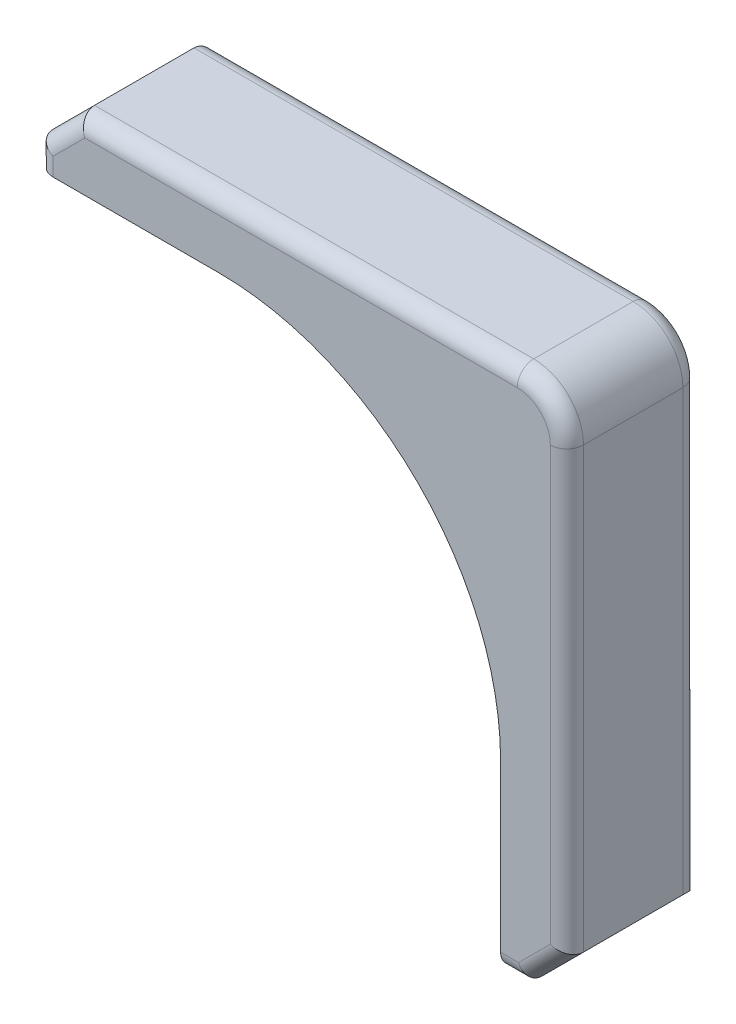
ISO-10303-21;
HEADER;
FILE_DESCRIPTION(('STEP AP214'),'2;1');
FILE_NAME('part.step','',(''),(''),'','','');
FILE_SCHEMA(('AUTOMOTIVE_DESIGN { 1 0 10303 214 1 1 1 1 }'));
ENDSEC;
DATA;
#1=APPLICATION_CONTEXT('core data for automotive mechanical design processes');
#2=APPLICATION_PROTOCOL_DEFINITION('international standard','automotive_design',2000,#1);
#3=PRODUCT_CONTEXT('',#1,'mechanical');
#4=PRODUCT('Part','Part','',(#3));
#5=PRODUCT_RELATED_PRODUCT_CATEGORY('part','',(#4));
#6=PRODUCT_DEFINITION_FORMATION('','',#4);
#7=PRODUCT_DEFINITION_CONTEXT('part definition',#1,'design');
#8=PRODUCT_DEFINITION('design','',#6,#7);
#9=PRODUCT_DEFINITION_SHAPE('','',#8);
#10=(LENGTH_UNIT() NAMED_UNIT(*) SI_UNIT(.MILLI.,.METRE.));
#11=(NAMED_UNIT(*) PLANE_ANGLE_UNIT() SI_UNIT($,.RADIAN.));
#12=(NAMED_UNIT(*) SI_UNIT($,.STERADIAN.) SOLID_ANGLE_UNIT());
#13=UNCERTAINTY_MEASURE_WITH_UNIT(LENGTH_MEASURE(1.E-05),#10,'distance_accuracy_value','');
#14=(GEOMETRIC_REPRESENTATION_CONTEXT(3) GLOBAL_UNCERTAINTY_ASSIGNED_CONTEXT((#13)) GLOBAL_UNIT_ASSIGNED_CONTEXT((#10,
#11,#12)) REPRESENTATION_CONTEXT('',''));
#15=CARTESIAN_POINT('',(0.,0.,0.));
#16=DIRECTION('',(0.,0.,1.));
#17=DIRECTION('',(1.,0.,0.));
#18=AXIS2_PLACEMENT_3D('',#15,#16,#17);
#19=CARTESIAN_POINT('',(-8.50000000000001,21.,8.));
#20=DIRECTION('',(0.707106781186548,-0.707106781186547,0.));
#21=DIRECTION('',(0.707106781186547,0.707106781186548,0.));
#22=AXIS2_PLACEMENT_3D('',#19,#20,#21);
#23=PLANE('',#22);
#24=DIRECTION('',(0.,0.,-1.));
#25=VECTOR('',#24,1.);
#26=CARTESIAN_POINT('',(-8.50000000000001,21.,8.));
#27=LINE('',#26,#25);
#28=CARTESIAN_POINT('',(-8.50000000000001,21.,7.));
#29=VERTEX_POINT('',#28);
#30=CARTESIAN_POINT('',(-8.50000000000001,21.,1.));
#31=VERTEX_POINT('',#30);
#32=EDGE_CURVE('E180',#29,#31,#27,.T.);
#33=ORIENTED_EDGE('',*,*,#32,.T.);
#34=DIRECTION('',(-0.707106781186547,-0.707106781186548,0.));
#35=VECTOR('',#34,1.);
#36=CARTESIAN_POINT('',(-8.50000000000001,21.,1.));
#37=LINE('',#36,#35);
#38=CARTESIAN_POINT('',(-11.,18.5,1.));
#39=VERTEX_POINT('',#38);
#40=EDGE_CURVE('E236',#31,#39,#37,.T.);
#41=ORIENTED_EDGE('',*,*,#40,.T.);
#42=DIRECTION('',(0.,0.,-1.));
#43=VECTOR('',#42,1.);
#44=CARTESIAN_POINT('',(-11.,18.5,8.));
#45=LINE('',#44,#43);
#46=CARTESIAN_POINT('',(-11.,18.5,7.));
#47=VERTEX_POINT('',#46);
#48=EDGE_CURVE('E212',#47,#39,#45,.T.);
#49=ORIENTED_EDGE('',*,*,#48,.F.);
#50=DIRECTION('',(-0.707106781186547,-0.707106781186548,0.));
#51=VECTOR('',#50,1.);
#52=CARTESIAN_POINT('',(-8.50000000000001,21.,7.));
#53=LINE('',#52,#51);
#54=EDGE_CURVE('E234',#47,#29,#53,.F.);
#55=ORIENTED_EDGE('',*,*,#54,.T.);
#56=EDGE_LOOP('',(#33,#41,#49,#55));
#57=FACE_BOUND('',#56,.T.);
#58=ADVANCED_FACE('F31',(#57),#23,.F.);
#59=CARTESIAN_POINT('',(-11.,18.5,8.));
#60=DIRECTION('',(1.,0.,0.));
#61=DIRECTION('',(0.,0.,-1.));
#62=AXIS2_PLACEMENT_3D('',#59,#60,#61);
#63=PLANE('',#62);
#64=ORIENTED_EDGE('',*,*,#48,.T.);
#65=DIRECTION('',(0.,-1.,0.));
#66=VECTOR('',#65,1.);
#67=CARTESIAN_POINT('',(-11.,18.5,1.));
#68=LINE('',#67,#66);
#69=CARTESIAN_POINT('',(-11.,17.,1.));
#70=VERTEX_POINT('',#69);
#71=EDGE_CURVE('E217',#39,#70,#68,.T.);
#72=ORIENTED_EDGE('',*,*,#71,.T.);
#73=DIRECTION('',(0.,0.,-1.));
#74=VECTOR('',#73,1.);
#75=CARTESIAN_POINT('',(-11.,17.,8.));
#76=LINE('',#75,#74);
#77=CARTESIAN_POINT('',(-11.,17.,7.));
#78=VERTEX_POINT('',#77);
#79=EDGE_CURVE('E172',#78,#70,#76,.T.);
#80=ORIENTED_EDGE('',*,*,#79,.F.);
#81=DIRECTION('',(0.,-1.,0.));
#82=VECTOR('',#81,1.);
#83=CARTESIAN_POINT('',(-11.,18.5,7.));
#84=LINE('',#83,#82);
#85=EDGE_CURVE('E215',#78,#47,#84,.F.);
#86=ORIENTED_EDGE('',*,*,#85,.T.);
#87=EDGE_LOOP('',(#64,#72,#80,#86));
#88=FACE_BOUND('',#87,.T.);
#89=ADVANCED_FACE('F305',(#88),#63,.F.);
#90=CARTESIAN_POINT('',(-11.,17.,8.));
#91=DIRECTION('',(0.,1.,0.));
#92=DIRECTION('',(0.,0.,1.));
#93=AXIS2_PLACEMENT_3D('',#90,#91,#92);
#94=PLANE('',#93);
#95=ORIENTED_EDGE('',*,*,#79,.T.);
#96=CARTESIAN_POINT('',(-10.,17.,1.));
#97=DIRECTION('',(0.,1.,0.));
#98=DIRECTION('',(0.,0.,1.));
#99=AXIS2_PLACEMENT_3D('',#96,#97,#98);
#100=CIRCLE('',#99,1.);
#101=CARTESIAN_POINT('',(-10.,17.,0.));
#102=VERTEX_POINT('',#101);
#103=EDGE_CURVE('E222',#70,#102,#100,.F.);
#104=ORIENTED_EDGE('',*,*,#103,.T.);
#105=DIRECTION('',(1.,0.,0.));
#106=VECTOR('',#105,1.);
#107=CARTESIAN_POINT('',(-11.,17.,0.));
#108=LINE('',#107,#106);
#109=CARTESIAN_POINT('',(0.,17.,0.));
#110=VERTEX_POINT('',#109);
#111=EDGE_CURVE('E169',#102,#110,#108,.T.);
#112=ORIENTED_EDGE('',*,*,#111,.T.);
#113=DIRECTION('',(0.,0.,-1.));
#114=VECTOR('',#113,1.);
#115=CARTESIAN_POINT('',(0.,17.,8.));
#116=LINE('',#115,#114);
#117=CARTESIAN_POINT('',(0.,17.,8.));
#118=VERTEX_POINT('',#117);
#119=EDGE_CURVE('E165',#118,#110,#116,.T.);
#120=ORIENTED_EDGE('',*,*,#119,.F.);
#121=DIRECTION('',(1.,0.,0.));
#122=VECTOR('',#121,1.);
#123=CARTESIAN_POINT('',(-11.,17.,8.));
#124=LINE('',#123,#122);
#125=CARTESIAN_POINT('',(-10.,17.,8.));
#126=VERTEX_POINT('',#125);
#127=EDGE_CURVE('E151',#126,#118,#124,.T.);
#128=ORIENTED_EDGE('',*,*,#127,.F.);
#129=CARTESIAN_POINT('',(-10.,17.,7.));
#130=DIRECTION('',(0.,1.,0.));
#131=DIRECTION('',(0.,0.,1.));
#132=AXIS2_PLACEMENT_3D('',#129,#130,#131);
#133=CIRCLE('',#132,1.);
#134=EDGE_CURVE('E220',#126,#78,#133,.F.);
#135=ORIENTED_EDGE('',*,*,#134,.T.);
#136=EDGE_LOOP('',(#95,#104,#112,#120,#128,#135));
#137=FACE_BOUND('',#136,.T.);
#138=ADVANCED_FACE('F167',(#137),#94,.F.);
#139=CARTESIAN_POINT('',(0.,0.,8.));
#140=DIRECTION('',(0.,0.,-1.));
#141=DIRECTION('',(-1.,0.,0.));
#142=AXIS2_PLACEMENT_3D('',#139,#140,#141);
#143=CYLINDRICAL_SURFACE('',#142,17.);
#144=CARTESIAN_POINT('',(0.,0.,0.));
#145=DIRECTION('',(0.,0.,-1.));
#146=DIRECTION('',(1.,0.,0.));
#147=AXIS2_PLACEMENT_3D('',#144,#145,#146);
#148=CIRCLE('',#147,17.);
#149=CARTESIAN_POINT('',(17.,0.,0.));
#150=VERTEX_POINT('',#149);
#151=EDGE_CURVE('E184',#110,#150,#148,.T.);
#152=ORIENTED_EDGE('',*,*,#151,.T.);
#153=DIRECTION('',(0.,0.,-1.));
#154=VECTOR('',#153,1.);
#155=CARTESIAN_POINT('',(17.,0.,8.));
#156=LINE('',#155,#154);
#157=CARTESIAN_POINT('',(17.,0.,8.));
#158=VERTEX_POINT('',#157);
#159=EDGE_CURVE('E173',#158,#150,#156,.T.);
#160=ORIENTED_EDGE('',*,*,#159,.F.);
#161=CARTESIAN_POINT('',(0.,0.,8.));
#162=DIRECTION('',(0.,0.,-1.));
#163=DIRECTION('',(1.,0.,0.));
#164=AXIS2_PLACEMENT_3D('',#161,#162,#163);
#165=CIRCLE('',#164,17.);
#166=EDGE_CURVE('E156',#118,#158,#165,.T.);
#167=ORIENTED_EDGE('',*,*,#166,.F.);
#168=ORIENTED_EDGE('',*,*,#119,.T.);
#169=EDGE_LOOP('',(#152,#160,#167,#168));
#170=FACE_BOUND('',#169,.T.);
#171=ADVANCED_FACE('F175',(#170),#143,.F.);
#172=CARTESIAN_POINT('',(17.,0.,8.));
#173=DIRECTION('',(1.,0.,0.));
#174=DIRECTION('',(0.,0.,-1.));
#175=AXIS2_PLACEMENT_3D('',#172,#173,#174);
#176=PLANE('',#175);
#177=DIRECTION('',(0.,0.,-1.));
#178=VECTOR('',#177,1.);
#179=CARTESIAN_POINT('',(17.,-11.,8.));
#180=LINE('',#179,#178);
#181=CARTESIAN_POINT('',(17.,-11.,7.));
#182=VERTEX_POINT('',#181);
#183=CARTESIAN_POINT('',(17.,-11.,0.));
#184=VERTEX_POINT('',#183);
#185=EDGE_CURVE('E208',#182,#184,#180,.T.);
#186=ORIENTED_EDGE('',*,*,#185,.F.);
#187=CARTESIAN_POINT('',(17.,-10.,7.));
#188=DIRECTION('',(1.,0.,0.));
#189=DIRECTION('',(0.,0.,-1.));
#190=AXIS2_PLACEMENT_3D('',#187,#188,#189);
#191=CIRCLE('',#190,1.);
#192=CARTESIAN_POINT('',(17.,-10.,8.));
#193=VERTEX_POINT('',#192);
#194=EDGE_CURVE('E11',#182,#193,#191,.F.);
#195=ORIENTED_EDGE('',*,*,#194,.T.);
#196=DIRECTION('',(0.,-1.,0.));
#197=VECTOR('',#196,1.);
#198=CARTESIAN_POINT('',(17.,0.,8.));
#199=LINE('',#198,#197);
#200=EDGE_CURVE('E178',#158,#193,#199,.T.);
#201=ORIENTED_EDGE('',*,*,#200,.F.);
#202=ORIENTED_EDGE('',*,*,#159,.T.);
#203=DIRECTION('',(0.,-1.,0.));
#204=VECTOR('',#203,1.);
#205=CARTESIAN_POINT('',(17.,0.,0.));
#206=LINE('',#205,#204);
#207=EDGE_CURVE('E187',#150,#184,#206,.T.);
#208=ORIENTED_EDGE('',*,*,#207,.T.);
#209=EDGE_LOOP('',(#186,#195,#201,#202,#208));
#210=FACE_BOUND('',#209,.T.);
#211=ADVANCED_FACE('F318',(#210),#176,.F.);
#212=CARTESIAN_POINT('',(17.,-11.,8.));
#213=DIRECTION('',(0.,1.,0.));
#214=DIRECTION('',(-1.,0.,0.));
#215=AXIS2_PLACEMENT_3D('',#212,#213,#214);
#216=PLANE('',#215);
#217=DIRECTION('',(0.,0.,-1.));
#218=VECTOR('',#217,1.);
#219=CARTESIAN_POINT('',(18.5,-11.,8.));
#220=LINE('',#219,#218);
#221=CARTESIAN_POINT('',(18.5,-11.,7.));
#222=VERTEX_POINT('',#221);
#223=CARTESIAN_POINT('',(18.5,-11.,0.));
#224=VERTEX_POINT('',#223);
#225=EDGE_CURVE('E206',#222,#224,#220,.T.);
#226=ORIENTED_EDGE('',*,*,#225,.F.);
#227=DIRECTION('',(1.,0.,0.));
#228=VECTOR('',#227,1.);
#229=CARTESIAN_POINT('',(17.,-11.,7.));
#230=LINE('',#229,#228);
#231=EDGE_CURVE('E40',#222,#182,#230,.F.);
#232=ORIENTED_EDGE('',*,*,#231,.T.);
#233=ORIENTED_EDGE('',*,*,#185,.T.);
#234=DIRECTION('',(1.,0.,0.));
#235=VECTOR('',#234,1.);
#236=CARTESIAN_POINT('',(17.,-11.,0.));
#237=LINE('',#236,#235);
#238=EDGE_CURVE('E190',#184,#224,#237,.T.);
#239=ORIENTED_EDGE('',*,*,#238,.T.);
#240=EDGE_LOOP('',(#226,#232,#233,#239));
#241=FACE_BOUND('',#240,.T.);
#242=ADVANCED_FACE('F376',(#241),#216,.F.);
#243=CARTESIAN_POINT('',(18.5,-11.,8.));
#244=DIRECTION('',(-0.707106781186549,0.707106781186546,0.));
#245=DIRECTION('',(-0.707106781186546,-0.707106781186549,0.));
#246=AXIS2_PLACEMENT_3D('',#243,#244,#245);
#247=PLANE('',#246);
#248=DIRECTION('',(0.707106781186546,0.707106781186549,0.));
#249=VECTOR('',#248,1.);
#250=CARTESIAN_POINT('',(18.5,-11.,0.));
#251=LINE('',#250,#249);
#252=CARTESIAN_POINT('',(20.,-9.50000000000001,0.));
#253=VERTEX_POINT('',#252);
#254=EDGE_CURVE('E162',#224,#253,#251,.T.);
#255=ORIENTED_EDGE('',*,*,#254,.T.);
#256=CARTESIAN_POINT('',(20.,-9.50000000000001,1.));
#257=DIRECTION('',(-0.707106781186549,0.707106781186546,0.));
#258=DIRECTION('',(0.707106781186546,0.707106781186549,0.));
#259=AXIS2_PLACEMENT_3D('',#256,#257,#258);
#260=ELLIPSE('',#259,1.4142135623731,1.);
#261=CARTESIAN_POINT('',(21.,-8.5,1.));
#262=VERTEX_POINT('',#261);
#263=EDGE_CURVE('E252',#253,#262,#260,.F.);
#264=ORIENTED_EDGE('',*,*,#263,.T.);
#265=DIRECTION('',(0.,0.,-1.));
#266=VECTOR('',#265,1.);
#267=CARTESIAN_POINT('',(21.,-8.5,8.));
#268=LINE('',#267,#266);
#269=CARTESIAN_POINT('',(21.,-8.5,7.));
#270=VERTEX_POINT('',#269);
#271=EDGE_CURVE('E203',#270,#262,#268,.T.);
#272=ORIENTED_EDGE('',*,*,#271,.F.);
#273=DIRECTION('',(0.707106781186546,0.707106781186549,0.));
#274=VECTOR('',#273,1.);
#275=CARTESIAN_POINT('',(18.5,-11.,7.));
#276=LINE('',#275,#274);
#277=EDGE_CURVE('E250',#270,#222,#276,.F.);
#278=ORIENTED_EDGE('',*,*,#277,.T.);
#279=ORIENTED_EDGE('',*,*,#225,.T.);
#280=EDGE_LOOP('',(#255,#264,#272,#278,#279));
#281=FACE_BOUND('',#280,.T.);
#282=ADVANCED_FACE('F366',(#281),#247,.F.);
#283=CARTESIAN_POINT('',(21.,-8.5,8.));
#284=DIRECTION('',(-1.,0.,0.));
#285=DIRECTION('',(0.,-1.,0.));
#286=AXIS2_PLACEMENT_3D('',#283,#284,#285);
#287=PLANE('',#286);
#288=ORIENTED_EDGE('',*,*,#271,.T.);
#289=DIRECTION('',(0.,1.,0.));
#290=VECTOR('',#289,1.);
#291=CARTESIAN_POINT('',(21.,-8.5,1.));
#292=LINE('',#291,#290);
#293=CARTESIAN_POINT('',(21.,18.,1.));
#294=VERTEX_POINT('',#293);
#295=EDGE_CURVE('E248',#262,#294,#292,.T.);
#296=ORIENTED_EDGE('',*,*,#295,.T.);
#297=DIRECTION('',(0.,0.,-1.));
#298=VECTOR('',#297,1.);
#299=CARTESIAN_POINT('',(21.,18.,8.));
#300=LINE('',#299,#298);
#301=CARTESIAN_POINT('',(21.,18.,7.));
#302=VERTEX_POINT('',#301);
#303=EDGE_CURVE('E200',#302,#294,#300,.T.);
#304=ORIENTED_EDGE('',*,*,#303,.F.);
#305=DIRECTION('',(0.,1.,0.));
#306=VECTOR('',#305,1.);
#307=CARTESIAN_POINT('',(21.,-8.5,7.));
#308=LINE('',#307,#306);
#309=EDGE_CURVE('E246',#302,#270,#308,.F.);
#310=ORIENTED_EDGE('',*,*,#309,.T.);
#311=EDGE_LOOP('',(#288,#296,#304,#310));
#312=FACE_BOUND('',#311,.T.);
#313=ADVANCED_FACE('F368',(#312),#287,.F.);
#314=CARTESIAN_POINT('',(18.,18.,8.));
#315=DIRECTION('',(0.,0.,-1.));
#316=DIRECTION('',(-1.,0.,0.));
#317=AXIS2_PLACEMENT_3D('',#314,#315,#316);
#318=CYLINDRICAL_SURFACE('',#317,3.);
#319=ORIENTED_EDGE('',*,*,#303,.T.);
#320=CARTESIAN_POINT('',(18.,18.,1.));
#321=DIRECTION('',(0.,0.,1.));
#322=DIRECTION('',(1.,0.,0.));
#323=AXIS2_PLACEMENT_3D('',#320,#321,#322);
#324=CIRCLE('',#323,3.);
#325=CARTESIAN_POINT('',(18.,21.,1.));
#326=VERTEX_POINT('',#325);
#327=EDGE_CURVE('E244',#294,#326,#324,.T.);
#328=ORIENTED_EDGE('',*,*,#327,.T.);
#329=DIRECTION('',(0.,0.,-1.));
#330=VECTOR('',#329,1.);
#331=CARTESIAN_POINT('',(18.,21.,8.));
#332=LINE('',#331,#330);
#333=CARTESIAN_POINT('',(18.,21.,7.));
#334=VERTEX_POINT('',#333);
#335=EDGE_CURVE('E197',#334,#326,#332,.T.);
#336=ORIENTED_EDGE('',*,*,#335,.F.);
#337=CARTESIAN_POINT('',(18.,18.,7.));
#338=DIRECTION('',(0.,0.,1.));
#339=DIRECTION('',(1.,0.,0.));
#340=AXIS2_PLACEMENT_3D('',#337,#338,#339);
#341=CIRCLE('',#340,3.);
#342=EDGE_CURVE('E242',#334,#302,#341,.F.);
#343=ORIENTED_EDGE('',*,*,#342,.T.);
#344=EDGE_LOOP('',(#319,#328,#336,#343));
#345=FACE_BOUND('',#344,.T.);
#346=ADVANCED_FACE('F342',(#345),#318,.T.);
#347=CARTESIAN_POINT('',(-8.50000000000001,21.,8.));
#348=DIRECTION('',(0.,-1.,0.));
#349=DIRECTION('',(1.,0.,0.));
#350=AXIS2_PLACEMENT_3D('',#347,#348,#349);
#351=PLANE('',#350);
#352=ORIENTED_EDGE('',*,*,#335,.T.);
#353=DIRECTION('',(-1.,0.,0.));
#354=VECTOR('',#353,1.);
#355=CARTESIAN_POINT('',(-8.50000000000001,21.,1.));
#356=LINE('',#355,#354);
#357=EDGE_CURVE('E240',#326,#31,#356,.T.);
#358=ORIENTED_EDGE('',*,*,#357,.T.);
#359=ORIENTED_EDGE('',*,*,#32,.F.);
#360=DIRECTION('',(-1.,0.,0.));
#361=VECTOR('',#360,1.);
#362=CARTESIAN_POINT('',(18.,21.,7.));
#363=LINE('',#362,#361);
#364=EDGE_CURVE('E238',#29,#334,#363,.F.);
#365=ORIENTED_EDGE('',*,*,#364,.T.);
#366=EDGE_LOOP('',(#352,#358,#359,#365));
#367=FACE_BOUND('',#366,.T.);
#368=ADVANCED_FACE('F339',(#367),#351,.F.);
#369=CARTESIAN_POINT('',(0.,0.,8.));
#370=DIRECTION('',(0.,0.,1.));
#371=DIRECTION('',(1.,0.,0.));
#372=AXIS2_PLACEMENT_3D('',#369,#370,#371);
#373=PLANE('',#372);
#374=ORIENTED_EDGE('',*,*,#200,.T.);
#375=DIRECTION('',(1.,0.,0.));
#376=VECTOR('',#375,1.);
#377=CARTESIAN_POINT('',(18.5,-10.,8.));
#378=LINE('',#377,#376);
#379=CARTESIAN_POINT('',(18.0857864376269,-10.,8.));
#380=VERTEX_POINT('',#379);
#381=EDGE_CURVE('E265',#193,#380,#378,.T.);
#382=ORIENTED_EDGE('',*,*,#381,.T.);
#383=DIRECTION('',(0.707106781186546,0.707106781186549,0.));
#384=VECTOR('',#383,1.);
#385=CARTESIAN_POINT('',(20.2928932188134,-7.79289321881346,8.));
#386=LINE('',#385,#384);
#387=CARTESIAN_POINT('',(20.,-8.08578643762691,8.));
#388=VERTEX_POINT('',#387);
#389=EDGE_CURVE('E263',#380,#388,#386,.T.);
#390=ORIENTED_EDGE('',*,*,#389,.T.);
#391=DIRECTION('',(0.,1.,0.));
#392=VECTOR('',#391,1.);
#393=CARTESIAN_POINT('',(20.,18.,8.));
#394=LINE('',#393,#392);
#395=CARTESIAN_POINT('',(20.,18.,8.));
#396=VERTEX_POINT('',#395);
#397=EDGE_CURVE('E261',#388,#396,#394,.T.);
#398=ORIENTED_EDGE('',*,*,#397,.T.);
#399=CARTESIAN_POINT('',(18.,18.,8.));
#400=DIRECTION('',(0.,0.,1.));
#401=DIRECTION('',(1.,0.,0.));
#402=AXIS2_PLACEMENT_3D('',#399,#400,#401);
#403=CIRCLE('',#402,2.);
#404=CARTESIAN_POINT('',(18.,20.,8.));
#405=VERTEX_POINT('',#404);
#406=EDGE_CURVE('E259',#396,#405,#403,.T.);
#407=ORIENTED_EDGE('',*,*,#406,.T.);
#408=DIRECTION('',(-1.,0.,0.));
#409=VECTOR('',#408,1.);
#410=CARTESIAN_POINT('',(-8.50000000000001,20.,8.));
#411=LINE('',#410,#409);
#412=CARTESIAN_POINT('',(-8.08578643762692,20.,8.));
#413=VERTEX_POINT('',#412);
#414=EDGE_CURVE('E257',#405,#413,#411,.T.);
#415=ORIENTED_EDGE('',*,*,#414,.T.);
#416=DIRECTION('',(-0.707106781186547,-0.707106781186548,0.));
#417=VECTOR('',#416,1.);
#418=CARTESIAN_POINT('',(-10.2928932188135,17.7928932188135,8.));
#419=LINE('',#418,#417);
#420=CARTESIAN_POINT('',(-10.,18.0857864376269,8.));
#421=VERTEX_POINT('',#420);
#422=EDGE_CURVE('E255',#413,#421,#419,.T.);
#423=ORIENTED_EDGE('',*,*,#422,.T.);
#424=DIRECTION('',(0.,-1.,0.));
#425=VECTOR('',#424,1.);
#426=CARTESIAN_POINT('',(-10.,17.,8.));
#427=LINE('',#426,#425);
#428=EDGE_CURVE('E159',#421,#126,#427,.T.);
#429=ORIENTED_EDGE('',*,*,#428,.T.);
#430=ORIENTED_EDGE('',*,*,#127,.T.);
#431=ORIENTED_EDGE('',*,*,#166,.T.);
#432=EDGE_LOOP('',(#374,#382,#390,#398,#407,#415,#423,#429,#430,#431));
#433=FACE_BOUND('',#432,.T.);
#434=ADVANCED_FACE('F154',(#433),#373,.T.);
#435=CARTESIAN_POINT('',(0.,0.,0.));
#436=DIRECTION('',(0.,0.,1.));
#437=DIRECTION('',(1.,0.,0.));
#438=AXIS2_PLACEMENT_3D('',#435,#436,#437);
#439=PLANE('',#438);
#440=ORIENTED_EDGE('',*,*,#111,.F.);
#441=DIRECTION('',(0.,-1.,0.));
#442=VECTOR('',#441,1.);
#443=CARTESIAN_POINT('',(-10.,0.,0.));
#444=LINE('',#443,#442);
#445=CARTESIAN_POINT('',(-10.,18.0857864376269,0.));
#446=VERTEX_POINT('',#445);
#447=EDGE_CURVE('E232',#102,#446,#444,.F.);
#448=ORIENTED_EDGE('',*,*,#447,.T.);
#449=DIRECTION('',(-0.707106781186547,-0.707106781186548,0.));
#450=VECTOR('',#449,1.);
#451=CARTESIAN_POINT('',(-14.0428932188135,14.0428932188135,0.));
#452=LINE('',#451,#450);
#453=CARTESIAN_POINT('',(-8.08578643762691,20.,0.));
#454=VERTEX_POINT('',#453);
#455=EDGE_CURVE('E230',#446,#454,#452,.F.);
#456=ORIENTED_EDGE('',*,*,#455,.T.);
#457=DIRECTION('',(-1.,0.,0.));
#458=VECTOR('',#457,1.);
#459=CARTESIAN_POINT('',(0.,20.,0.));
#460=LINE('',#459,#458);
#461=CARTESIAN_POINT('',(18.,20.,0.));
#462=VERTEX_POINT('',#461);
#463=EDGE_CURVE('E228',#454,#462,#460,.F.);
#464=ORIENTED_EDGE('',*,*,#463,.T.);
#465=CARTESIAN_POINT('',(18.,18.,0.));
#466=DIRECTION('',(0.,0.,1.));
#467=DIRECTION('',(1.,0.,0.));
#468=AXIS2_PLACEMENT_3D('',#465,#466,#467);
#469=CIRCLE('',#468,2.);
#470=CARTESIAN_POINT('',(20.,18.,0.));
#471=VERTEX_POINT('',#470);
#472=EDGE_CURVE('E226',#462,#471,#469,.F.);
#473=ORIENTED_EDGE('',*,*,#472,.T.);
#474=DIRECTION('',(0.,1.,0.));
#475=VECTOR('',#474,1.);
#476=CARTESIAN_POINT('',(20.,0.,0.));
#477=LINE('',#476,#475);
#478=EDGE_CURVE('E224',#471,#253,#477,.F.);
#479=ORIENTED_EDGE('',*,*,#478,.T.);
#480=ORIENTED_EDGE('',*,*,#254,.F.);
#481=ORIENTED_EDGE('',*,*,#238,.F.);
#482=ORIENTED_EDGE('',*,*,#207,.F.);
#483=ORIENTED_EDGE('',*,*,#151,.F.);
#484=EDGE_LOOP('',(#440,#448,#456,#464,#473,#479,#480,#481,#482,#483));
#485=FACE_BOUND('',#484,.T.);
#486=ADVANCED_FACE('F313',(#485),#439,.F.);
#487=CARTESIAN_POINT('',(20.,-8.5,1.));
#488=DIRECTION('',(0.,1.,0.));
#489=DIRECTION('',(-1.,0.,0.));
#490=AXIS2_PLACEMENT_3D('',#487,#488,#489);
#491=CYLINDRICAL_SURFACE('',#490,1.);
#492=ORIENTED_EDGE('',*,*,#263,.F.);
#493=ORIENTED_EDGE('',*,*,#478,.F.);
#494=CARTESIAN_POINT('',(20.,18.,1.));
#495=DIRECTION('',(0.,1.,0.));
#496=DIRECTION('',(0.,0.,1.));
#497=AXIS2_PLACEMENT_3D('',#494,#495,#496);
#498=CIRCLE('',#497,1.);
#499=EDGE_CURVE('E185',#294,#471,#498,.T.);
#500=ORIENTED_EDGE('',*,*,#499,.F.);
#501=ORIENTED_EDGE('',*,*,#295,.F.);
#502=EDGE_LOOP('',(#492,#493,#500,#501));
#503=FACE_BOUND('',#502,.T.);
#504=ADVANCED_FACE('F362',(#503),#491,.T.);
#505=CARTESIAN_POINT('',(18.,18.,1.));
#506=DIRECTION('',(0.,0.,1.));
#507=DIRECTION('',(1.,0.,0.));
#508=AXIS2_PLACEMENT_3D('',#505,#506,#507);
#509=TOROIDAL_SURFACE('',#508,2.,1.);
#510=ORIENTED_EDGE('',*,*,#499,.T.);
#511=ORIENTED_EDGE('',*,*,#472,.F.);
#512=CARTESIAN_POINT('',(18.,20.,1.));
#513=DIRECTION('',(-1.,0.,0.));
#514=DIRECTION('',(0.,0.,1.));
#515=AXIS2_PLACEMENT_3D('',#512,#513,#514);
#516=CIRCLE('',#515,1.);
#517=EDGE_CURVE('E275',#326,#462,#516,.T.);
#518=ORIENTED_EDGE('',*,*,#517,.F.);
#519=ORIENTED_EDGE('',*,*,#327,.F.);
#520=EDGE_LOOP('',(#510,#511,#518,#519));
#521=FACE_BOUND('',#520,.T.);
#522=ADVANCED_FACE('F347',(#521),#509,.T.);
#523=CARTESIAN_POINT('',(-8.50000000000001,20.,1.));
#524=DIRECTION('',(-1.,0.,0.));
#525=DIRECTION('',(0.,-1.,0.));
#526=AXIS2_PLACEMENT_3D('',#523,#524,#525);
#527=CYLINDRICAL_SURFACE('',#526,1.);
#528=ORIENTED_EDGE('',*,*,#517,.T.);
#529=ORIENTED_EDGE('',*,*,#463,.F.);
#530=CARTESIAN_POINT('',(-8.08578643762691,20.,1.));
#531=DIRECTION('',(-0.923879532511287,-0.38268343236509,0.));
#532=DIRECTION('',(-0.38268343236509,0.923879532511287,0.));
#533=AXIS2_PLACEMENT_3D('',#530,#531,#532);
#534=ELLIPSE('',#533,1.08239220029239,1.);
#535=EDGE_CURVE('E272',#31,#454,#534,.T.);
#536=ORIENTED_EDGE('',*,*,#535,.F.);
#537=ORIENTED_EDGE('',*,*,#357,.F.);
#538=EDGE_LOOP('',(#528,#529,#536,#537));
#539=FACE_BOUND('',#538,.T.);
#540=ADVANCED_FACE('F353',(#539),#527,.T.);
#541=CARTESIAN_POINT('',(-7.79289321881346,20.2928932188135,1.));
#542=DIRECTION('',(-0.707106781186547,-0.707106781186548,0.));
#543=DIRECTION('',(0.707106781186548,-0.707106781186547,0.));
#544=AXIS2_PLACEMENT_3D('',#541,#542,#543);
#545=CYLINDRICAL_SURFACE('',#544,1.);
#546=ORIENTED_EDGE('',*,*,#535,.T.);
#547=ORIENTED_EDGE('',*,*,#455,.F.);
#548=CARTESIAN_POINT('',(-10.,18.0857864376269,1.));
#549=DIRECTION('',(-0.38268343236509,-0.923879532511287,0.));
#550=DIRECTION('',(-0.923879532511287,0.38268343236509,0.));
#551=AXIS2_PLACEMENT_3D('',#548,#549,#550);
#552=ELLIPSE('',#551,1.08239220029239,1.);
#553=EDGE_CURVE('E269',#39,#446,#552,.T.);
#554=ORIENTED_EDGE('',*,*,#553,.F.);
#555=ORIENTED_EDGE('',*,*,#40,.F.);
#556=EDGE_LOOP('',(#546,#547,#554,#555));
#557=FACE_BOUND('',#556,.T.);
#558=ADVANCED_FACE('F357',(#557),#545,.T.);
#559=CARTESIAN_POINT('',(-10.,18.5,1.));
#560=DIRECTION('',(0.,-1.,0.));
#561=DIRECTION('',(0.,0.,-1.));
#562=AXIS2_PLACEMENT_3D('',#559,#560,#561);
#563=CYLINDRICAL_SURFACE('',#562,1.);
#564=ORIENTED_EDGE('',*,*,#553,.T.);
#565=ORIENTED_EDGE('',*,*,#447,.F.);
#566=ORIENTED_EDGE('',*,*,#103,.F.);
#567=ORIENTED_EDGE('',*,*,#71,.F.);
#568=EDGE_LOOP('',(#564,#565,#566,#567));
#569=FACE_BOUND('',#568,.T.);
#570=ADVANCED_FACE('F310',(#569),#563,.T.);
#571=CARTESIAN_POINT('',(-10.,0.,7.));
#572=DIRECTION('',(0.,1.,0.));
#573=DIRECTION('',(0.,0.,1.));
#574=AXIS2_PLACEMENT_3D('',#571,#572,#573);
#575=CYLINDRICAL_SURFACE('',#574,1.);
#576=ORIENTED_EDGE('',*,*,#134,.F.);
#577=ORIENTED_EDGE('',*,*,#428,.F.);
#578=CARTESIAN_POINT('',(-10.,18.0857864376269,7.));
#579=DIRECTION('',(0.38268343236509,0.923879532511287,0.));
#580=DIRECTION('',(-0.923879532511287,0.38268343236509,0.));
#581=AXIS2_PLACEMENT_3D('',#578,#579,#580);
#582=ELLIPSE('',#581,1.08239220029239,1.);
#583=EDGE_CURVE('E35',#47,#421,#582,.T.);
#584=ORIENTED_EDGE('',*,*,#583,.F.);
#585=ORIENTED_EDGE('',*,*,#85,.F.);
#586=EDGE_LOOP('',(#576,#577,#584,#585));
#587=FACE_BOUND('',#586,.T.);
#588=ADVANCED_FACE('F33',(#587),#575,.T.);
#589=CARTESIAN_POINT('',(-14.0428932188135,14.0428932188135,7.));
#590=DIRECTION('',(0.707106781186547,0.707106781186548,0.));
#591=DIRECTION('',(-0.707106781186548,0.707106781186547,0.));
#592=AXIS2_PLACEMENT_3D('',#589,#590,#591);
#593=CYLINDRICAL_SURFACE('',#592,1.);
#594=ORIENTED_EDGE('',*,*,#583,.T.);
#595=ORIENTED_EDGE('',*,*,#422,.F.);
#596=CARTESIAN_POINT('',(-8.08578643762691,20.,7.));
#597=DIRECTION('',(0.923879532511287,0.38268343236509,0.));
#598=DIRECTION('',(-0.38268343236509,0.923879532511287,0.));
#599=AXIS2_PLACEMENT_3D('',#596,#597,#598);
#600=ELLIPSE('',#599,1.08239220029239,1.);
#601=EDGE_CURVE('E289',#29,#413,#600,.T.);
#602=ORIENTED_EDGE('',*,*,#601,.F.);
#603=ORIENTED_EDGE('',*,*,#54,.F.);
#604=EDGE_LOOP('',(#594,#595,#602,#603));
#605=FACE_BOUND('',#604,.T.);
#606=ADVANCED_FACE('F300',(#605),#593,.T.);
#607=CARTESIAN_POINT('',(0.,20.,7.));
#608=DIRECTION('',(1.,0.,0.));
#609=DIRECTION('',(0.,1.,0.));
#610=AXIS2_PLACEMENT_3D('',#607,#608,#609);
#611=CYLINDRICAL_SURFACE('',#610,1.);
#612=ORIENTED_EDGE('',*,*,#601,.T.);
#613=ORIENTED_EDGE('',*,*,#414,.F.);
#614=CARTESIAN_POINT('',(18.,20.,7.));
#615=DIRECTION('',(1.,0.,0.));
#616=DIRECTION('',(0.,0.,-1.));
#617=AXIS2_PLACEMENT_3D('',#614,#615,#616);
#618=CIRCLE('',#617,1.);
#619=EDGE_CURVE('E287',#334,#405,#618,.T.);
#620=ORIENTED_EDGE('',*,*,#619,.F.);
#621=ORIENTED_EDGE('',*,*,#364,.F.);
#622=EDGE_LOOP('',(#612,#613,#620,#621));
#623=FACE_BOUND('',#622,.T.);
#624=ADVANCED_FACE('F335',(#623),#611,.T.);
#625=CARTESIAN_POINT('',(18.,18.,7.));
#626=DIRECTION('',(0.,0.,1.));
#627=DIRECTION('',(1.,0.,0.));
#628=AXIS2_PLACEMENT_3D('',#625,#626,#627);
#629=TOROIDAL_SURFACE('',#628,2.,1.);
#630=ORIENTED_EDGE('',*,*,#619,.T.);
#631=ORIENTED_EDGE('',*,*,#406,.F.);
#632=CARTESIAN_POINT('',(20.,18.,7.));
#633=DIRECTION('',(0.,-1.,0.));
#634=DIRECTION('',(0.,0.,-1.));
#635=AXIS2_PLACEMENT_3D('',#632,#633,#634);
#636=CIRCLE('',#635,1.);
#637=EDGE_CURVE('E284',#302,#396,#636,.T.);
#638=ORIENTED_EDGE('',*,*,#637,.F.);
#639=ORIENTED_EDGE('',*,*,#342,.F.);
#640=EDGE_LOOP('',(#630,#631,#638,#639));
#641=FACE_BOUND('',#640,.T.);
#642=ADVANCED_FACE('F333',(#641),#629,.T.);
#643=CARTESIAN_POINT('',(20.,0.,7.));
#644=DIRECTION('',(0.,-1.,0.));
#645=DIRECTION('',(1.,0.,0.));
#646=AXIS2_PLACEMENT_3D('',#643,#644,#645);
#647=CYLINDRICAL_SURFACE('',#646,1.);
#648=ORIENTED_EDGE('',*,*,#637,.T.);
#649=ORIENTED_EDGE('',*,*,#397,.F.);
#650=CARTESIAN_POINT('',(20.,-8.08578643762691,7.));
#651=DIRECTION('',(-0.382683432365089,-0.923879532511287,0.));
#652=DIRECTION('',(0.923879532511287,-0.382683432365089,0.));
#653=AXIS2_PLACEMENT_3D('',#650,#651,#652);
#654=ELLIPSE('',#653,1.08239220029239,1.);
#655=EDGE_CURVE('E281',#270,#388,#654,.T.);
#656=ORIENTED_EDGE('',*,*,#655,.F.);
#657=ORIENTED_EDGE('',*,*,#309,.F.);
#658=EDGE_LOOP('',(#648,#649,#656,#657));
#659=FACE_BOUND('',#658,.T.);
#660=ADVANCED_FACE('F328',(#659),#647,.T.);
#661=CARTESIAN_POINT('',(14.0428932188135,-14.0428932188134,7.));
#662=DIRECTION('',(-0.707106781186546,-0.707106781186549,0.));
#663=DIRECTION('',(0.707106781186549,-0.707106781186546,0.));
#664=AXIS2_PLACEMENT_3D('',#661,#662,#663);
#665=CYLINDRICAL_SURFACE('',#664,1.);
#666=ORIENTED_EDGE('',*,*,#655,.T.);
#667=ORIENTED_EDGE('',*,*,#389,.F.);
#668=CARTESIAN_POINT('',(18.0857864376269,-10.,7.));
#669=DIRECTION('',(-0.923879532511287,-0.38268343236509,0.));
#670=DIRECTION('',(0.38268343236509,-0.923879532511287,0.));
#671=AXIS2_PLACEMENT_3D('',#668,#669,#670);
#672=ELLIPSE('',#671,1.08239220029239,1.);
#673=EDGE_CURVE('E54',#222,#380,#672,.T.);
#674=ORIENTED_EDGE('',*,*,#673,.F.);
#675=ORIENTED_EDGE('',*,*,#277,.F.);
#676=EDGE_LOOP('',(#666,#667,#674,#675));
#677=FACE_BOUND('',#676,.T.);
#678=ADVANCED_FACE('F323',(#677),#665,.T.);
#679=CARTESIAN_POINT('',(0.,-9.99999999999999,7.));
#680=DIRECTION('',(-1.,0.,0.));
#681=DIRECTION('',(0.,-1.,0.));
#682=AXIS2_PLACEMENT_3D('',#679,#680,#681);
#683=CYLINDRICAL_SURFACE('',#682,1.);
#684=ORIENTED_EDGE('',*,*,#194,.F.);
#685=ORIENTED_EDGE('',*,*,#231,.F.);
#686=ORIENTED_EDGE('',*,*,#673,.T.);
#687=ORIENTED_EDGE('',*,*,#381,.F.);
#688=EDGE_LOOP('',(#684,#685,#686,#687));
#689=FACE_BOUND('',#688,.T.);
#690=ADVANCED_FACE('F320',(#689),#683,.T.);
#691=CLOSED_SHELL('',(#58,#89,#138,#171,#211,#242,#282,#313,#346,#368,#434,#486,#504,#522,#540,
#558,#570,#588,#606,#624,#642,#660,#678,#690));
#692=MANIFOLD_SOLID_BREP('B2',#691);
#693=ADVANCED_BREP_SHAPE_REPRESENTATION('',(#18,#692),#14);
#694=SHAPE_DEFINITION_REPRESENTATION(#9,#693);
ENDSEC;
END-ISO-10303-21;
